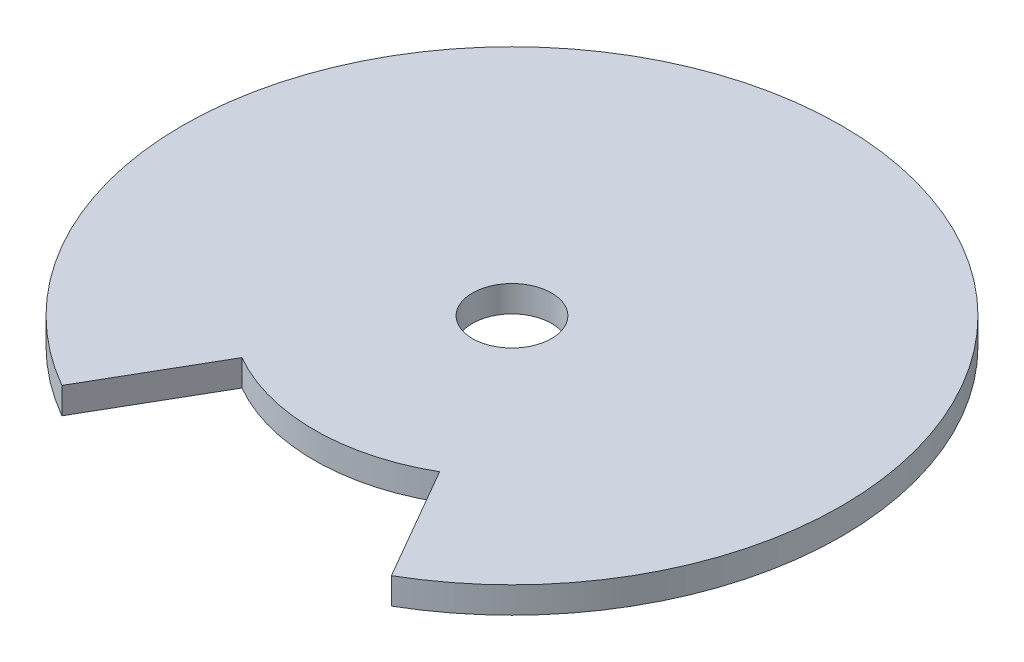
ISO-10303-21;
HEADER;
FILE_DESCRIPTION(('STEP AP214'),'2;1');
FILE_NAME('part.step','',(''),(''),'','','');
FILE_SCHEMA(('AUTOMOTIVE_DESIGN { 1 0 10303 214 1 1 1 1 }'));
ENDSEC;
DATA;
#1=APPLICATION_CONTEXT('core data for automotive mechanical design processes');
#2=APPLICATION_PROTOCOL_DEFINITION('international standard','automotive_design',2000,#1);
#3=PRODUCT_CONTEXT('',#1,'mechanical');
#4=PRODUCT('Part','Part','',(#3));
#5=PRODUCT_RELATED_PRODUCT_CATEGORY('part','',(#4));
#6=PRODUCT_DEFINITION_FORMATION('','',#4);
#7=PRODUCT_DEFINITION_CONTEXT('part definition',#1,'design');
#8=PRODUCT_DEFINITION('design','',#6,#7);
#9=PRODUCT_DEFINITION_SHAPE('','',#8);
#10=(LENGTH_UNIT() NAMED_UNIT(*) SI_UNIT(.MILLI.,.METRE.));
#11=(NAMED_UNIT(*) PLANE_ANGLE_UNIT() SI_UNIT($,.RADIAN.));
#12=(NAMED_UNIT(*) SI_UNIT($,.STERADIAN.) SOLID_ANGLE_UNIT());
#13=UNCERTAINTY_MEASURE_WITH_UNIT(LENGTH_MEASURE(1.E-05),#10,'distance_accuracy_value','');
#14=(GEOMETRIC_REPRESENTATION_CONTEXT(3) GLOBAL_UNCERTAINTY_ASSIGNED_CONTEXT((#13)) GLOBAL_UNIT_ASSIGNED_CONTEXT((#10,
#11,#12)) REPRESENTATION_CONTEXT('',''));
#15=CARTESIAN_POINT('',(0.,0.,0.));
#16=DIRECTION('',(0.,0.,1.));
#17=DIRECTION('',(1.,0.,0.));
#18=AXIS2_PLACEMENT_3D('',#15,#16,#17);
#19=CARTESIAN_POINT('',(0.,2.,0.));
#20=DIRECTION('',(0.,-1.,0.));
#21=DIRECTION('',(0.,0.,-1.));
#22=AXIS2_PLACEMENT_3D('',#19,#20,#21);
#23=CYLINDRICAL_SURFACE('',#22,15.);
#24=CARTESIAN_POINT('',(0.,0.,0.));
#25=DIRECTION('',(0.,1.,0.));
#26=DIRECTION('',(0.,0.,1.));
#27=AXIS2_PLACEMENT_3D('',#24,#25,#26);
#28=CIRCLE('',#27,15.);
#29=CARTESIAN_POINT('',(-7.50000000000001,0.,12.9903810567666));
#30=VERTEX_POINT('',#29);
#31=CARTESIAN_POINT('',(7.50000000000002,0.,12.9903810567666));
#32=VERTEX_POINT('',#31);
#33=EDGE_CURVE('E104',#30,#32,#28,.T.);
#34=ORIENTED_EDGE('',*,*,#33,.T.);
#35=DIRECTION('',(0.,-1.,0.));
#36=VECTOR('',#35,1.);
#37=CARTESIAN_POINT('',(7.50000000000002,2.,12.9903810567666));
#38=LINE('',#37,#36);
#39=CARTESIAN_POINT('',(7.50000000000002,2.,12.9903810567666));
#40=VERTEX_POINT('',#39);
#41=EDGE_CURVE('E11',#40,#32,#38,.T.);
#42=ORIENTED_EDGE('',*,*,#41,.F.);
#43=CARTESIAN_POINT('',(0.,2.,0.));
#44=DIRECTION('',(0.,1.,0.));
#45=DIRECTION('',(0.,0.,1.));
#46=AXIS2_PLACEMENT_3D('',#43,#44,#45);
#47=CIRCLE('',#46,15.);
#48=CARTESIAN_POINT('',(-7.50000000000001,2.,12.9903810567666));
#49=VERTEX_POINT('',#48);
#50=EDGE_CURVE('E87',#49,#40,#47,.T.);
#51=ORIENTED_EDGE('',*,*,#50,.F.);
#52=DIRECTION('',(0.,-1.,0.));
#53=VECTOR('',#52,1.);
#54=CARTESIAN_POINT('',(-7.50000000000001,2.,12.9903810567666));
#55=LINE('',#54,#53);
#56=EDGE_CURVE('E53',#49,#30,#55,.T.);
#57=ORIENTED_EDGE('',*,*,#56,.T.);
#58=EDGE_LOOP('',(#34,#42,#51,#57));
#59=FACE_BOUND('',#58,.T.);
#60=ADVANCED_FACE('F37',(#59),#23,.T.);
#61=CARTESIAN_POINT('',(0.,2.,0.));
#62=DIRECTION('',(0.866025403784438,0.,-0.500000000000001));
#63=DIRECTION('',(-0.500000000000001,0.,-0.866025403784438));
#64=AXIS2_PLACEMENT_3D('',#61,#62,#63);
#65=PLANE('',#64);
#66=DIRECTION('',(0.500000000000001,0.,0.866025403784438));
#67=VECTOR('',#66,1.);
#68=CARTESIAN_POINT('',(0.,0.,0.));
#69=LINE('',#68,#67);
#70=CARTESIAN_POINT('',(12.5,0.,21.6506350946109));
#71=VERTEX_POINT('',#70);
#72=EDGE_CURVE('E92',#32,#71,#69,.T.);
#73=ORIENTED_EDGE('',*,*,#72,.T.);
#74=DIRECTION('',(0.,-1.,0.));
#75=VECTOR('',#74,1.);
#76=CARTESIAN_POINT('',(12.5,2.,21.6506350946109));
#77=LINE('',#76,#75);
#78=CARTESIAN_POINT('',(12.5,2.,21.6506350946109));
#79=VERTEX_POINT('',#78);
#80=EDGE_CURVE('E45',#79,#71,#77,.T.);
#81=ORIENTED_EDGE('',*,*,#80,.F.);
#82=DIRECTION('',(0.500000000000001,0.,0.866025403784438));
#83=VECTOR('',#82,1.);
#84=CARTESIAN_POINT('',(0.,2.,0.));
#85=LINE('',#84,#83);
#86=EDGE_CURVE('E79',#40,#79,#85,.T.);
#87=ORIENTED_EDGE('',*,*,#86,.F.);
#88=ORIENTED_EDGE('',*,*,#41,.T.);
#89=EDGE_LOOP('',(#73,#81,#87,#88));
#90=FACE_BOUND('',#89,.T.);
#91=ADVANCED_FACE('F91',(#90),#65,.F.);
#92=CARTESIAN_POINT('',(0.,2.,0.));
#93=DIRECTION('',(0.,-1.,0.));
#94=DIRECTION('',(0.,0.,-1.));
#95=AXIS2_PLACEMENT_3D('',#92,#93,#94);
#96=CYLINDRICAL_SURFACE('',#95,25.);
#97=CARTESIAN_POINT('',(0.,0.,0.));
#98=DIRECTION('',(0.,1.,0.));
#99=DIRECTION('',(0.,0.,1.));
#100=AXIS2_PLACEMENT_3D('',#97,#98,#99);
#101=CIRCLE('',#100,25.);
#102=CARTESIAN_POINT('',(-12.5,0.,21.650635094611));
#103=VERTEX_POINT('',#102);
#104=EDGE_CURVE('E107',#71,#103,#101,.T.);
#105=ORIENTED_EDGE('',*,*,#104,.T.);
#106=DIRECTION('',(0.,-1.,0.));
#107=VECTOR('',#106,1.);
#108=CARTESIAN_POINT('',(-12.5,2.,21.650635094611));
#109=LINE('',#108,#107);
#110=CARTESIAN_POINT('',(-12.5,2.,21.650635094611));
#111=VERTEX_POINT('',#110);
#112=EDGE_CURVE('E68',#111,#103,#109,.T.);
#113=ORIENTED_EDGE('',*,*,#112,.F.);
#114=CARTESIAN_POINT('',(0.,2.,0.));
#115=DIRECTION('',(0.,1.,0.));
#116=DIRECTION('',(0.,0.,1.));
#117=AXIS2_PLACEMENT_3D('',#114,#115,#116);
#118=CIRCLE('',#117,25.);
#119=EDGE_CURVE('E86',#79,#111,#118,.T.);
#120=ORIENTED_EDGE('',*,*,#119,.F.);
#121=ORIENTED_EDGE('',*,*,#80,.T.);
#122=EDGE_LOOP('',(#105,#113,#120,#121));
#123=FACE_BOUND('',#122,.T.);
#124=ADVANCED_FACE('F95',(#123),#96,.T.);
#125=CARTESIAN_POINT('',(0.,2.,0.));
#126=DIRECTION('',(0.866025403784438,0.,0.500000000000001));
#127=DIRECTION('',(0.500000000000001,0.,-0.866025403784438));
#128=AXIS2_PLACEMENT_3D('',#125,#126,#127);
#129=PLANE('',#128);
#130=DIRECTION('',(-0.500000000000001,0.,0.866025403784438));
#131=VECTOR('',#130,1.);
#132=CARTESIAN_POINT('',(0.,0.,0.));
#133=LINE('',#132,#131);
#134=EDGE_CURVE('E109',#30,#103,#133,.T.);
#135=ORIENTED_EDGE('',*,*,#134,.F.);
#136=ORIENTED_EDGE('',*,*,#56,.F.);
#137=DIRECTION('',(-0.500000000000001,0.,0.866025403784438));
#138=VECTOR('',#137,1.);
#139=CARTESIAN_POINT('',(0.,2.,0.));
#140=LINE('',#139,#138);
#141=EDGE_CURVE('E96',#49,#111,#140,.T.);
#142=ORIENTED_EDGE('',*,*,#141,.T.);
#143=ORIENTED_EDGE('',*,*,#112,.T.);
#144=EDGE_LOOP('',(#135,#136,#142,#143));
#145=FACE_BOUND('',#144,.T.);
#146=ADVANCED_FACE('F122',(#145),#129,.T.);
#147=CARTESIAN_POINT('',(0.,2.,0.));
#148=DIRECTION('',(0.,-1.,0.));
#149=DIRECTION('',(0.,0.,-1.));
#150=AXIS2_PLACEMENT_3D('',#147,#148,#149);
#151=CYLINDRICAL_SURFACE('',#150,3.);
#152=CARTESIAN_POINT('',(0.,2.,0.));
#153=DIRECTION('',(0.,1.,0.));
#154=DIRECTION('',(0.,0.,1.));
#155=AXIS2_PLACEMENT_3D('',#152,#153,#154);
#156=CIRCLE('',#155,3.);
#157=CARTESIAN_POINT('',(0.,2.,3.));
#158=VERTEX_POINT('',#157);
#159=EDGE_CURVE('E98',#158,#158,#156,.T.);
#160=ORIENTED_EDGE('',*,*,#159,.T.);
#161=EDGE_LOOP('',(#160));
#162=FACE_BOUND('',#161,.T.);
#163=CARTESIAN_POINT('',(0.,0.,0.));
#164=DIRECTION('',(0.,1.,0.));
#165=DIRECTION('',(0.,0.,1.));
#166=AXIS2_PLACEMENT_3D('',#163,#164,#165);
#167=CIRCLE('',#166,3.);
#168=CARTESIAN_POINT('',(0.,0.,3.));
#169=VERTEX_POINT('',#168);
#170=EDGE_CURVE('E112',#169,#169,#167,.T.);
#171=ORIENTED_EDGE('',*,*,#170,.F.);
#172=EDGE_LOOP('',(#171));
#173=FACE_BOUND('',#172,.T.);
#174=ADVANCED_FACE('F120',(#162,#173),#151,.F.);
#175=CARTESIAN_POINT('',(0.,2.,0.));
#176=DIRECTION('',(0.,1.,0.));
#177=DIRECTION('',(0.,0.,1.));
#178=AXIS2_PLACEMENT_3D('',#175,#176,#177);
#179=PLANE('',#178);
#180=ORIENTED_EDGE('',*,*,#50,.T.);
#181=ORIENTED_EDGE('',*,*,#86,.T.);
#182=ORIENTED_EDGE('',*,*,#119,.T.);
#183=ORIENTED_EDGE('',*,*,#141,.F.);
#184=EDGE_LOOP('',(#180,#181,#182,#183));
#185=FACE_BOUND('',#184,.T.);
#186=ORIENTED_EDGE('',*,*,#159,.F.);
#187=EDGE_LOOP('',(#186));
#188=FACE_BOUND('',#187,.T.);
#189=ADVANCED_FACE('F82',(#185,#188),#179,.T.);
#190=CARTESIAN_POINT('',(0.,0.,0.));
#191=DIRECTION('',(0.,1.,0.));
#192=DIRECTION('',(0.,0.,1.));
#193=AXIS2_PLACEMENT_3D('',#190,#191,#192);
#194=PLANE('',#193);
#195=ORIENTED_EDGE('',*,*,#33,.F.);
#196=ORIENTED_EDGE('',*,*,#134,.T.);
#197=ORIENTED_EDGE('',*,*,#104,.F.);
#198=ORIENTED_EDGE('',*,*,#72,.F.);
#199=EDGE_LOOP('',(#195,#196,#197,#198));
#200=FACE_BOUND('',#199,.T.);
#201=ORIENTED_EDGE('',*,*,#170,.T.);
#202=EDGE_LOOP('',(#201));
#203=FACE_BOUND('',#202,.T.);
#204=ADVANCED_FACE('F118',(#200,#203),#194,.F.);
#205=CLOSED_SHELL('',(#60,#91,#124,#146,#174,#189,#204));
#206=MANIFOLD_SOLID_BREP('B2',#205);
#207=ADVANCED_BREP_SHAPE_REPRESENTATION('',(#18,#206),#14);
#208=SHAPE_DEFINITION_REPRESENTATION(#9,#207);
ENDSEC;
END-ISO-10303-21;
